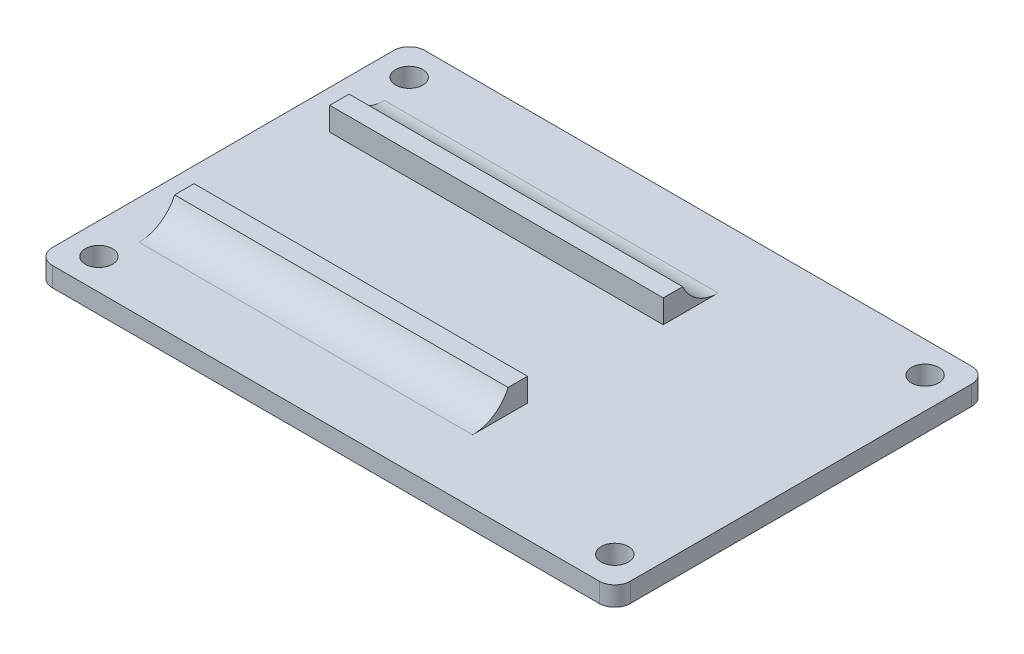
ISO-10303-21;
HEADER;
FILE_DESCRIPTION(('STEP AP214'),'2;1');
FILE_NAME('part.step','',(''),(''),'','','');
FILE_SCHEMA(('AUTOMOTIVE_DESIGN { 1 0 10303 214 1 1 1 1 }'));
ENDSEC;
DATA;
#1=APPLICATION_CONTEXT('core data for automotive mechanical design processes');
#2=APPLICATION_PROTOCOL_DEFINITION('international standard','automotive_design',2000,#1);
#3=PRODUCT_CONTEXT('',#1,'mechanical');
#4=PRODUCT('Part','Part','',(#3));
#5=PRODUCT_RELATED_PRODUCT_CATEGORY('part','',(#4));
#6=PRODUCT_DEFINITION_FORMATION('','',#4);
#7=PRODUCT_DEFINITION_CONTEXT('part definition',#1,'design');
#8=PRODUCT_DEFINITION('design','',#6,#7);
#9=PRODUCT_DEFINITION_SHAPE('','',#8);
#10=(LENGTH_UNIT() NAMED_UNIT(*) SI_UNIT(.MILLI.,.METRE.));
#11=(NAMED_UNIT(*) PLANE_ANGLE_UNIT() SI_UNIT($,.RADIAN.));
#12=(NAMED_UNIT(*) SI_UNIT($,.STERADIAN.) SOLID_ANGLE_UNIT());
#13=UNCERTAINTY_MEASURE_WITH_UNIT(LENGTH_MEASURE(1.E-05),#10,'distance_accuracy_value','');
#14=(GEOMETRIC_REPRESENTATION_CONTEXT(3) GLOBAL_UNCERTAINTY_ASSIGNED_CONTEXT((#13)) GLOBAL_UNIT_ASSIGNED_CONTEXT((#10,
#11,#12)) REPRESENTATION_CONTEXT('',''));
#15=CARTESIAN_POINT('',(0.,0.,0.));
#16=DIRECTION('',(0.,0.,1.));
#17=DIRECTION('',(1.,0.,0.));
#18=AXIS2_PLACEMENT_3D('',#15,#16,#17);
#19=CARTESIAN_POINT('',(-52.4762747985287,2.5,24.6659710997723));
#20=DIRECTION('',(0.,-1.,0.));
#21=DIRECTION('',(0.,0.,-1.));
#22=AXIS2_PLACEMENT_3D('',#19,#20,#21);
#23=PLANE('',#22);
#24=DIRECTION('',(0.,0.,1.));
#25=VECTOR('',#24,1.);
#26=CARTESIAN_POINT('',(-49.4762747985287,2.5,-8.58402890022771));
#27=LINE('',#26,#25);
#28=CARTESIAN_POINT('',(-49.4762747985287,2.5,-13.1666045951835));
#29=VERTEX_POINT('',#28);
#30=CARTESIAN_POINT('',(-49.4762747985287,2.5,-6.08402890022771));
#31=VERTEX_POINT('',#30);
#32=EDGE_CURVE('E48',#29,#31,#27,.T.);
#33=ORIENTED_EDGE('',*,*,#32,.F.);
#34=DIRECTION('',(-1.,0.,0.));
#35=VECTOR('',#34,1.);
#36=CARTESIAN_POINT('',(-52.4762747985287,2.5,-13.1666045951835));
#37=LINE('',#36,#35);
#38=CARTESIAN_POINT('',(-6.47627479852869,2.5,-13.1666045951835));
#39=VERTEX_POINT('',#38);
#40=EDGE_CURVE('E281',#29,#39,#37,.F.);
#41=ORIENTED_EDGE('',*,*,#40,.T.);
#42=DIRECTION('',(0.,0.,-1.));
#43=VECTOR('',#42,1.);
#44=CARTESIAN_POINT('',(-6.47627479852869,2.5,-6.08402890022771));
#45=LINE('',#44,#43);
#46=CARTESIAN_POINT('',(-6.47627479852869,2.5,-6.08402890022771));
#47=VERTEX_POINT('',#46);
#48=EDGE_CURVE('E56',#47,#39,#45,.T.);
#49=ORIENTED_EDGE('',*,*,#48,.F.);
#50=DIRECTION('',(1.,0.,0.));
#51=VECTOR('',#50,1.);
#52=CARTESIAN_POINT('',(-49.4762747985287,2.5,-6.08402890022771));
#53=LINE('',#52,#51);
#54=EDGE_CURVE('E172',#31,#47,#53,.T.);
#55=ORIENTED_EDGE('',*,*,#54,.F.);
#56=EDGE_LOOP('',(#33,#41,#49,#55));
#57=FACE_BOUND('',#56,.T.);
#58=CARTESIAN_POINT('',(-52.4762747985287,2.5,24.6659710997723));
#59=DIRECTION('',(0.,1.,0.));
#60=DIRECTION('',(0.,0.,-1.));
#61=AXIS2_PLACEMENT_3D('',#58,#59,#60);
#62=CIRCLE('',#61,2.);
#63=CARTESIAN_POINT('',(-54.4762747985287,2.5,24.6659710997723));
#64=VERTEX_POINT('',#63);
#65=CARTESIAN_POINT('',(-52.4762747985287,2.5,26.6659710997723));
#66=VERTEX_POINT('',#65);
#67=EDGE_CURVE('E221',#64,#66,#62,.T.);
#68=ORIENTED_EDGE('',*,*,#67,.T.);
#69=DIRECTION('',(1.,0.,0.));
#70=VECTOR('',#69,1.);
#71=CARTESIAN_POINT('',(18.0237252014713,2.5,26.6659710997723));
#72=LINE('',#71,#70);
#73=CARTESIAN_POINT('',(18.0237252014713,2.5,26.6659710997723));
#74=VERTEX_POINT('',#73);
#75=EDGE_CURVE('E224',#66,#74,#72,.T.);
#76=ORIENTED_EDGE('',*,*,#75,.T.);
#77=CARTESIAN_POINT('',(18.0237252014713,2.5,24.6659710997723));
#78=DIRECTION('',(0.,1.,0.));
#79=DIRECTION('',(0.,0.,-1.));
#80=AXIS2_PLACEMENT_3D('',#77,#78,#79);
#81=CIRCLE('',#80,2.);
#82=CARTESIAN_POINT('',(20.0237252014713,2.5,24.6659710997723));
#83=VERTEX_POINT('',#82);
#84=EDGE_CURVE('E227',#74,#83,#81,.T.);
#85=ORIENTED_EDGE('',*,*,#84,.T.);
#86=DIRECTION('',(0.,0.,-1.));
#87=VECTOR('',#86,1.);
#88=CARTESIAN_POINT('',(20.0237252014713,2.5,-19.3340289002277));
#89=LINE('',#88,#87);
#90=CARTESIAN_POINT('',(20.0237252014713,2.5,-19.3340289002277));
#91=VERTEX_POINT('',#90);
#92=EDGE_CURVE('E229',#83,#91,#89,.T.);
#93=ORIENTED_EDGE('',*,*,#92,.T.);
#94=CARTESIAN_POINT('',(18.0237252014713,2.5,-19.3340289002277));
#95=DIRECTION('',(0.,1.,0.));
#96=DIRECTION('',(0.,0.,-1.));
#97=AXIS2_PLACEMENT_3D('',#94,#95,#96);
#98=CIRCLE('',#97,2.);
#99=CARTESIAN_POINT('',(18.0237252014713,2.5,-21.3340289002277));
#100=VERTEX_POINT('',#99);
#101=EDGE_CURVE('E231',#91,#100,#98,.T.);
#102=ORIENTED_EDGE('',*,*,#101,.T.);
#103=DIRECTION('',(-1.,0.,0.));
#104=VECTOR('',#103,1.);
#105=CARTESIAN_POINT('',(-52.4762747985287,2.5,-21.3340289002277));
#106=LINE('',#105,#104);
#107=CARTESIAN_POINT('',(-52.4762747985287,2.5,-21.3340289002277));
#108=VERTEX_POINT('',#107);
#109=EDGE_CURVE('E233',#100,#108,#106,.T.);
#110=ORIENTED_EDGE('',*,*,#109,.T.);
#111=CARTESIAN_POINT('',(-52.4762747985287,2.5,-19.3340289002277));
#112=DIRECTION('',(0.,1.,0.));
#113=DIRECTION('',(0.,0.,-1.));
#114=AXIS2_PLACEMENT_3D('',#111,#112,#113);
#115=CIRCLE('',#114,2.);
#116=CARTESIAN_POINT('',(-54.4762747985287,2.5,-19.3340289002277));
#117=VERTEX_POINT('',#116);
#118=EDGE_CURVE('E235',#108,#117,#115,.T.);
#119=ORIENTED_EDGE('',*,*,#118,.T.);
#120=DIRECTION('',(0.,0.,1.));
#121=VECTOR('',#120,1.);
#122=CARTESIAN_POINT('',(-54.4762747985287,2.5,24.6659710997723));
#123=LINE('',#122,#121);
#124=EDGE_CURVE('E237',#117,#64,#123,.T.);
#125=ORIENTED_EDGE('',*,*,#124,.T.);
#126=EDGE_LOOP('',(#68,#76,#85,#93,#102,#110,#119,#125));
#127=FACE_BOUND('',#126,.T.);
#128=CARTESIAN_POINT('',(-50.4762747985287,2.5,-17.3340289002277));
#129=DIRECTION('',(0.,1.,0.));
#130=DIRECTION('',(0.,0.,1.));
#131=AXIS2_PLACEMENT_3D('',#128,#129,#130);
#132=CIRCLE('',#131,1.75);
#133=CARTESIAN_POINT('',(-50.4762747985287,2.5,-15.5840289002277));
#134=VERTEX_POINT('',#133);
#135=EDGE_CURVE('E215',#134,#134,#132,.T.);
#136=ORIENTED_EDGE('',*,*,#135,.F.);
#137=EDGE_LOOP('',(#136));
#138=FACE_BOUND('',#137,.T.);
#139=CARTESIAN_POINT('',(16.0237252014713,2.5,-17.3340289002277));
#140=DIRECTION('',(0.,1.,0.));
#141=DIRECTION('',(0.,0.,1.));
#142=AXIS2_PLACEMENT_3D('',#139,#140,#141);
#143=CIRCLE('',#142,1.75);
#144=CARTESIAN_POINT('',(16.0237252014713,2.5,-15.5840289002277));
#145=VERTEX_POINT('',#144);
#146=EDGE_CURVE('E209',#145,#145,#143,.T.);
#147=ORIENTED_EDGE('',*,*,#146,.F.);
#148=EDGE_LOOP('',(#147));
#149=FACE_BOUND('',#148,.T.);
#150=CARTESIAN_POINT('',(16.0237252014713,2.5,22.6659710997723));
#151=DIRECTION('',(0.,1.,0.));
#152=DIRECTION('',(0.,0.,1.));
#153=AXIS2_PLACEMENT_3D('',#150,#151,#152);
#154=CIRCLE('',#153,1.75);
#155=CARTESIAN_POINT('',(16.0237252014713,2.5,24.4159710997723));
#156=VERTEX_POINT('',#155);
#157=EDGE_CURVE('E203',#156,#156,#154,.T.);
#158=ORIENTED_EDGE('',*,*,#157,.F.);
#159=EDGE_LOOP('',(#158));
#160=FACE_BOUND('',#159,.T.);
#161=CARTESIAN_POINT('',(-50.4762747985287,2.5,22.6659710997723));
#162=DIRECTION('',(0.,1.,0.));
#163=DIRECTION('',(0.,0.,1.));
#164=AXIS2_PLACEMENT_3D('',#161,#162,#163);
#165=CIRCLE('',#164,1.75);
#166=CARTESIAN_POINT('',(-50.4762747985287,2.5,24.4159710997723));
#167=VERTEX_POINT('',#166);
#168=EDGE_CURVE('E197',#167,#167,#165,.T.);
#169=ORIENTED_EDGE('',*,*,#168,.F.);
#170=EDGE_LOOP('',(#169));
#171=FACE_BOUND('',#170,.T.);
#172=DIRECTION('',(0.,0.,-1.));
#173=VECTOR('',#172,1.);
#174=CARTESIAN_POINT('',(-6.47627479852869,2.5,13.9159710997723));
#175=LINE('',#174,#173);
#176=CARTESIAN_POINT('',(-6.47627479852869,2.5,18.4985467947281));
#177=VERTEX_POINT('',#176);
#178=CARTESIAN_POINT('',(-6.47627479852869,2.5,11.4159710997723));
#179=VERTEX_POINT('',#178);
#180=EDGE_CURVE('E170',#177,#179,#175,.T.);
#181=ORIENTED_EDGE('',*,*,#180,.F.);
#182=DIRECTION('',(1.,0.,0.));
#183=VECTOR('',#182,1.);
#184=CARTESIAN_POINT('',(-52.4762747985287,2.5,18.4985467947281));
#185=LINE('',#184,#183);
#186=CARTESIAN_POINT('',(-49.4762747985287,2.5,18.4985467947281));
#187=VERTEX_POINT('',#186);
#188=EDGE_CURVE('E278',#177,#187,#185,.F.);
#189=ORIENTED_EDGE('',*,*,#188,.T.);
#190=DIRECTION('',(0.,0.,1.));
#191=VECTOR('',#190,1.);
#192=CARTESIAN_POINT('',(-49.4762747985287,2.5,11.4159710997723));
#193=LINE('',#192,#191);
#194=CARTESIAN_POINT('',(-49.4762747985287,2.5,11.4159710997723));
#195=VERTEX_POINT('',#194);
#196=EDGE_CURVE('E167',#195,#187,#193,.T.);
#197=ORIENTED_EDGE('',*,*,#196,.F.);
#198=DIRECTION('',(-1.,0.,0.));
#199=VECTOR('',#198,1.);
#200=CARTESIAN_POINT('',(-6.47627479852869,2.5,11.4159710997723));
#201=LINE('',#200,#199);
#202=EDGE_CURVE('E290',#179,#195,#201,.T.);
#203=ORIENTED_EDGE('',*,*,#202,.F.);
#204=EDGE_LOOP('',(#181,#189,#197,#203));
#205=FACE_BOUND('',#204,.T.);
#206=ADVANCED_FACE('F33',(#57,#127,#138,#149,#160,#171,#205),#23,.F.);
#207=CARTESIAN_POINT('',(-52.4762747985287,0.,24.6659710997723));
#208=DIRECTION('',(0.,-1.,0.));
#209=DIRECTION('',(0.,0.,-1.));
#210=AXIS2_PLACEMENT_3D('',#207,#208,#209);
#211=PLANE('',#210);
#212=CARTESIAN_POINT('',(16.0237252014713,0.,22.6659710997723));
#213=DIRECTION('',(0.,1.,0.));
#214=DIRECTION('',(0.,0.,1.));
#215=AXIS2_PLACEMENT_3D('',#212,#213,#214);
#216=CIRCLE('',#215,1.75);
#217=CARTESIAN_POINT('',(16.0237252014713,0.,24.4159710997723));
#218=VERTEX_POINT('',#217);
#219=EDGE_CURVE('E200',#218,#218,#216,.T.);
#220=ORIENTED_EDGE('',*,*,#219,.T.);
#221=EDGE_LOOP('',(#220));
#222=FACE_BOUND('',#221,.T.);
#223=CARTESIAN_POINT('',(-50.4762747985287,0.,-17.3340289002277));
#224=DIRECTION('',(0.,1.,0.));
#225=DIRECTION('',(0.,0.,1.));
#226=AXIS2_PLACEMENT_3D('',#223,#224,#225);
#227=CIRCLE('',#226,1.75);
#228=CARTESIAN_POINT('',(-50.4762747985287,0.,-15.5840289002277));
#229=VERTEX_POINT('',#228);
#230=EDGE_CURVE('E212',#229,#229,#227,.T.);
#231=ORIENTED_EDGE('',*,*,#230,.T.);
#232=EDGE_LOOP('',(#231));
#233=FACE_BOUND('',#232,.T.);
#234=CARTESIAN_POINT('',(-52.4762747985287,0.,24.6659710997723));
#235=DIRECTION('',(0.,1.,0.));
#236=DIRECTION('',(0.,0.,-1.));
#237=AXIS2_PLACEMENT_3D('',#234,#235,#236);
#238=CIRCLE('',#237,2.);
#239=CARTESIAN_POINT('',(-54.4762747985287,0.,24.6659710997723));
#240=VERTEX_POINT('',#239);
#241=CARTESIAN_POINT('',(-52.4762747985287,0.,26.6659710997723));
#242=VERTEX_POINT('',#241);
#243=EDGE_CURVE('E218',#240,#242,#238,.T.);
#244=ORIENTED_EDGE('',*,*,#243,.F.);
#245=DIRECTION('',(0.,0.,1.));
#246=VECTOR('',#245,1.);
#247=CARTESIAN_POINT('',(-54.4762747985287,0.,24.6659710997723));
#248=LINE('',#247,#246);
#249=CARTESIAN_POINT('',(-54.4762747985287,0.,-19.3340289002277));
#250=VERTEX_POINT('',#249);
#251=EDGE_CURVE('E225',#250,#240,#248,.T.);
#252=ORIENTED_EDGE('',*,*,#251,.F.);
#253=CARTESIAN_POINT('',(-52.4762747985287,0.,-19.3340289002277));
#254=DIRECTION('',(0.,1.,0.));
#255=DIRECTION('',(0.,0.,-1.));
#256=AXIS2_PLACEMENT_3D('',#253,#254,#255);
#257=CIRCLE('',#256,2.);
#258=CARTESIAN_POINT('',(-52.4762747985287,0.,-21.3340289002277));
#259=VERTEX_POINT('',#258);
#260=EDGE_CURVE('E252',#259,#250,#257,.T.);
#261=ORIENTED_EDGE('',*,*,#260,.F.);
#262=DIRECTION('',(-1.,0.,0.));
#263=VECTOR('',#262,1.);
#264=CARTESIAN_POINT('',(-52.4762747985287,0.,-21.3340289002277));
#265=LINE('',#264,#263);
#266=CARTESIAN_POINT('',(18.0237252014713,0.,-21.3340289002277));
#267=VERTEX_POINT('',#266);
#268=EDGE_CURVE('E250',#267,#259,#265,.T.);
#269=ORIENTED_EDGE('',*,*,#268,.F.);
#270=CARTESIAN_POINT('',(18.0237252014713,0.,-19.3340289002277));
#271=DIRECTION('',(0.,1.,0.));
#272=DIRECTION('',(0.,0.,-1.));
#273=AXIS2_PLACEMENT_3D('',#270,#271,#272);
#274=CIRCLE('',#273,2.);
#275=CARTESIAN_POINT('',(20.0237252014713,0.,-19.3340289002277));
#276=VERTEX_POINT('',#275);
#277=EDGE_CURVE('E248',#276,#267,#274,.T.);
#278=ORIENTED_EDGE('',*,*,#277,.F.);
#279=DIRECTION('',(0.,0.,-1.));
#280=VECTOR('',#279,1.);
#281=CARTESIAN_POINT('',(20.0237252014713,0.,-19.3340289002277));
#282=LINE('',#281,#280);
#283=CARTESIAN_POINT('',(20.0237252014713,0.,24.6659710997723));
#284=VERTEX_POINT('',#283);
#285=EDGE_CURVE('E246',#284,#276,#282,.T.);
#286=ORIENTED_EDGE('',*,*,#285,.F.);
#287=CARTESIAN_POINT('',(18.0237252014713,0.,24.6659710997723));
#288=DIRECTION('',(0.,1.,0.));
#289=DIRECTION('',(0.,0.,-1.));
#290=AXIS2_PLACEMENT_3D('',#287,#288,#289);
#291=CIRCLE('',#290,2.);
#292=CARTESIAN_POINT('',(18.0237252014713,0.,26.6659710997723));
#293=VERTEX_POINT('',#292);
#294=EDGE_CURVE('E244',#293,#284,#291,.T.);
#295=ORIENTED_EDGE('',*,*,#294,.F.);
#296=DIRECTION('',(1.,0.,0.));
#297=VECTOR('',#296,1.);
#298=CARTESIAN_POINT('',(18.0237252014713,0.,26.6659710997723));
#299=LINE('',#298,#297);
#300=EDGE_CURVE('E242',#242,#293,#299,.T.);
#301=ORIENTED_EDGE('',*,*,#300,.F.);
#302=EDGE_LOOP('',(#244,#252,#261,#269,#278,#286,#295,#301));
#303=FACE_BOUND('',#302,.T.);
#304=CARTESIAN_POINT('',(16.0237252014713,0.,-17.3340289002277));
#305=DIRECTION('',(0.,1.,0.));
#306=DIRECTION('',(0.,0.,1.));
#307=AXIS2_PLACEMENT_3D('',#304,#305,#306);
#308=CIRCLE('',#307,1.75);
#309=CARTESIAN_POINT('',(16.0237252014713,0.,-15.5840289002277));
#310=VERTEX_POINT('',#309);
#311=EDGE_CURVE('E206',#310,#310,#308,.T.);
#312=ORIENTED_EDGE('',*,*,#311,.T.);
#313=EDGE_LOOP('',(#312));
#314=FACE_BOUND('',#313,.T.);
#315=CARTESIAN_POINT('',(-50.4762747985287,0.,22.6659710997723));
#316=DIRECTION('',(0.,1.,0.));
#317=DIRECTION('',(0.,0.,1.));
#318=AXIS2_PLACEMENT_3D('',#315,#316,#317);
#319=CIRCLE('',#318,1.75);
#320=CARTESIAN_POINT('',(-50.4762747985287,0.,24.4159710997723));
#321=VERTEX_POINT('',#320);
#322=EDGE_CURVE('E196',#321,#321,#319,.T.);
#323=ORIENTED_EDGE('',*,*,#322,.T.);
#324=EDGE_LOOP('',(#323));
#325=FACE_BOUND('',#324,.T.);
#326=ADVANCED_FACE('F307',(#222,#233,#303,#314,#325),#211,.T.);
#327=CARTESIAN_POINT('',(-52.4762747985287,2.5,24.6659710997723));
#328=DIRECTION('',(0.,-1.,0.));
#329=DIRECTION('',(0.,0.,-1.));
#330=AXIS2_PLACEMENT_3D('',#327,#328,#329);
#331=CYLINDRICAL_SURFACE('',#330,2.);
#332=ORIENTED_EDGE('',*,*,#243,.T.);
#333=DIRECTION('',(0.,-1.,0.));
#334=VECTOR('',#333,1.);
#335=CARTESIAN_POINT('',(-52.4762747985287,2.5,26.6659710997723));
#336=LINE('',#335,#334);
#337=EDGE_CURVE('E275',#66,#242,#336,.T.);
#338=ORIENTED_EDGE('',*,*,#337,.F.);
#339=ORIENTED_EDGE('',*,*,#67,.F.);
#340=DIRECTION('',(0.,-1.,0.));
#341=VECTOR('',#340,1.);
#342=CARTESIAN_POINT('',(-54.4762747985287,2.5,24.6659710997723));
#343=LINE('',#342,#341);
#344=EDGE_CURVE('E239',#64,#240,#343,.T.);
#345=ORIENTED_EDGE('',*,*,#344,.T.);
#346=EDGE_LOOP('',(#332,#338,#339,#345));
#347=FACE_BOUND('',#346,.T.);
#348=ADVANCED_FACE('F312',(#347),#331,.T.);
#349=CARTESIAN_POINT('',(18.0237252014713,2.5,26.6659710997723));
#350=DIRECTION('',(0.,0.,-1.));
#351=DIRECTION('',(-1.,0.,0.));
#352=AXIS2_PLACEMENT_3D('',#349,#350,#351);
#353=PLANE('',#352);
#354=ORIENTED_EDGE('',*,*,#300,.T.);
#355=DIRECTION('',(0.,-1.,0.));
#356=VECTOR('',#355,1.);
#357=CARTESIAN_POINT('',(18.0237252014713,2.5,26.6659710997723));
#358=LINE('',#357,#356);
#359=EDGE_CURVE('E272',#74,#293,#358,.T.);
#360=ORIENTED_EDGE('',*,*,#359,.F.);
#361=ORIENTED_EDGE('',*,*,#75,.F.);
#362=ORIENTED_EDGE('',*,*,#337,.T.);
#363=EDGE_LOOP('',(#354,#360,#361,#362));
#364=FACE_BOUND('',#363,.T.);
#365=ADVANCED_FACE('F343',(#364),#353,.F.);
#366=CARTESIAN_POINT('',(18.0237252014713,2.5,24.6659710997723));
#367=DIRECTION('',(0.,-1.,0.));
#368=DIRECTION('',(0.,0.,-1.));
#369=AXIS2_PLACEMENT_3D('',#366,#367,#368);
#370=CYLINDRICAL_SURFACE('',#369,2.);
#371=ORIENTED_EDGE('',*,*,#294,.T.);
#372=DIRECTION('',(0.,-1.,0.));
#373=VECTOR('',#372,1.);
#374=CARTESIAN_POINT('',(20.0237252014713,2.5,24.6659710997723));
#375=LINE('',#374,#373);
#376=EDGE_CURVE('E269',#83,#284,#375,.T.);
#377=ORIENTED_EDGE('',*,*,#376,.F.);
#378=ORIENTED_EDGE('',*,*,#84,.F.);
#379=ORIENTED_EDGE('',*,*,#359,.T.);
#380=EDGE_LOOP('',(#371,#377,#378,#379));
#381=FACE_BOUND('',#380,.T.);
#382=ADVANCED_FACE('F339',(#381),#370,.T.);
#383=CARTESIAN_POINT('',(20.0237252014713,2.5,-19.3340289002277));
#384=DIRECTION('',(-1.,0.,0.));
#385=DIRECTION('',(0.,0.,1.));
#386=AXIS2_PLACEMENT_3D('',#383,#384,#385);
#387=PLANE('',#386);
#388=ORIENTED_EDGE('',*,*,#285,.T.);
#389=DIRECTION('',(0.,-1.,0.));
#390=VECTOR('',#389,1.);
#391=CARTESIAN_POINT('',(20.0237252014713,2.5,-19.3340289002277));
#392=LINE('',#391,#390);
#393=EDGE_CURVE('E266',#91,#276,#392,.T.);
#394=ORIENTED_EDGE('',*,*,#393,.F.);
#395=ORIENTED_EDGE('',*,*,#92,.F.);
#396=ORIENTED_EDGE('',*,*,#376,.T.);
#397=EDGE_LOOP('',(#388,#394,#395,#396));
#398=FACE_BOUND('',#397,.T.);
#399=ADVANCED_FACE('F335',(#398),#387,.F.);
#400=CARTESIAN_POINT('',(18.0237252014713,2.5,-19.3340289002277));
#401=DIRECTION('',(0.,-1.,0.));
#402=DIRECTION('',(0.,0.,-1.));
#403=AXIS2_PLACEMENT_3D('',#400,#401,#402);
#404=CYLINDRICAL_SURFACE('',#403,2.);
#405=ORIENTED_EDGE('',*,*,#277,.T.);
#406=DIRECTION('',(0.,-1.,0.));
#407=VECTOR('',#406,1.);
#408=CARTESIAN_POINT('',(18.0237252014713,2.5,-21.3340289002277));
#409=LINE('',#408,#407);
#410=EDGE_CURVE('E263',#100,#267,#409,.T.);
#411=ORIENTED_EDGE('',*,*,#410,.F.);
#412=ORIENTED_EDGE('',*,*,#101,.F.);
#413=ORIENTED_EDGE('',*,*,#393,.T.);
#414=EDGE_LOOP('',(#405,#411,#412,#413));
#415=FACE_BOUND('',#414,.T.);
#416=ADVANCED_FACE('F331',(#415),#404,.T.);
#417=CARTESIAN_POINT('',(-52.4762747985287,2.5,-21.3340289002277));
#418=DIRECTION('',(0.,0.,1.));
#419=DIRECTION('',(1.,0.,0.));
#420=AXIS2_PLACEMENT_3D('',#417,#418,#419);
#421=PLANE('',#420);
#422=ORIENTED_EDGE('',*,*,#268,.T.);
#423=DIRECTION('',(0.,-1.,0.));
#424=VECTOR('',#423,1.);
#425=CARTESIAN_POINT('',(-52.4762747985287,2.5,-21.3340289002277));
#426=LINE('',#425,#424);
#427=EDGE_CURVE('E260',#108,#259,#426,.T.);
#428=ORIENTED_EDGE('',*,*,#427,.F.);
#429=ORIENTED_EDGE('',*,*,#109,.F.);
#430=ORIENTED_EDGE('',*,*,#410,.T.);
#431=EDGE_LOOP('',(#422,#428,#429,#430));
#432=FACE_BOUND('',#431,.T.);
#433=ADVANCED_FACE('F327',(#432),#421,.F.);
#434=CARTESIAN_POINT('',(-52.4762747985287,2.5,-19.3340289002277));
#435=DIRECTION('',(0.,-1.,0.));
#436=DIRECTION('',(0.,0.,-1.));
#437=AXIS2_PLACEMENT_3D('',#434,#435,#436);
#438=CYLINDRICAL_SURFACE('',#437,2.);
#439=ORIENTED_EDGE('',*,*,#260,.T.);
#440=DIRECTION('',(0.,-1.,0.));
#441=VECTOR('',#440,1.);
#442=CARTESIAN_POINT('',(-54.4762747985287,2.5,-19.3340289002277));
#443=LINE('',#442,#441);
#444=EDGE_CURVE('E257',#117,#250,#443,.T.);
#445=ORIENTED_EDGE('',*,*,#444,.F.);
#446=ORIENTED_EDGE('',*,*,#118,.F.);
#447=ORIENTED_EDGE('',*,*,#427,.T.);
#448=EDGE_LOOP('',(#439,#445,#446,#447));
#449=FACE_BOUND('',#448,.T.);
#450=ADVANCED_FACE('F323',(#449),#438,.T.);
#451=CARTESIAN_POINT('',(-54.4762747985287,2.5,24.6659710997723));
#452=DIRECTION('',(1.,0.,0.));
#453=DIRECTION('',(0.,0.,-1.));
#454=AXIS2_PLACEMENT_3D('',#451,#452,#453);
#455=PLANE('',#454);
#456=ORIENTED_EDGE('',*,*,#251,.T.);
#457=ORIENTED_EDGE('',*,*,#344,.F.);
#458=ORIENTED_EDGE('',*,*,#124,.F.);
#459=ORIENTED_EDGE('',*,*,#444,.T.);
#460=EDGE_LOOP('',(#456,#457,#458,#459));
#461=FACE_BOUND('',#460,.T.);
#462=ADVANCED_FACE('F320',(#461),#455,.F.);
#463=CARTESIAN_POINT('',(-50.4762747985287,2.5,-17.3340289002277));
#464=DIRECTION('',(0.,-1.,0.));
#465=DIRECTION('',(0.,0.,-1.));
#466=AXIS2_PLACEMENT_3D('',#463,#464,#465);
#467=CYLINDRICAL_SURFACE('',#466,1.75);
#468=ORIENTED_EDGE('',*,*,#135,.T.);
#469=EDGE_LOOP('',(#468));
#470=FACE_BOUND('',#469,.T.);
#471=ORIENTED_EDGE('',*,*,#230,.F.);
#472=EDGE_LOOP('',(#471));
#473=FACE_BOUND('',#472,.T.);
#474=ADVANCED_FACE('F317',(#470,#473),#467,.F.);
#475=CARTESIAN_POINT('',(16.0237252014713,2.5,-17.3340289002277));
#476=DIRECTION('',(0.,-1.,0.));
#477=DIRECTION('',(0.,0.,-1.));
#478=AXIS2_PLACEMENT_3D('',#475,#476,#477);
#479=CYLINDRICAL_SURFACE('',#478,1.75);
#480=ORIENTED_EDGE('',*,*,#146,.T.);
#481=EDGE_LOOP('',(#480));
#482=FACE_BOUND('',#481,.T.);
#483=ORIENTED_EDGE('',*,*,#311,.F.);
#484=EDGE_LOOP('',(#483));
#485=FACE_BOUND('',#484,.T.);
#486=ADVANCED_FACE('F383',(#482,#485),#479,.F.);
#487=CARTESIAN_POINT('',(16.0237252014713,2.5,22.6659710997723));
#488=DIRECTION('',(0.,-1.,0.));
#489=DIRECTION('',(0.,0.,-1.));
#490=AXIS2_PLACEMENT_3D('',#487,#488,#489);
#491=CYLINDRICAL_SURFACE('',#490,1.75);
#492=ORIENTED_EDGE('',*,*,#157,.T.);
#493=EDGE_LOOP('',(#492));
#494=FACE_BOUND('',#493,.T.);
#495=ORIENTED_EDGE('',*,*,#219,.F.);
#496=EDGE_LOOP('',(#495));
#497=FACE_BOUND('',#496,.T.);
#498=ADVANCED_FACE('F377',(#494,#497),#491,.F.);
#499=CARTESIAN_POINT('',(-50.4762747985287,2.5,22.6659710997723));
#500=DIRECTION('',(0.,-1.,0.));
#501=DIRECTION('',(0.,0.,-1.));
#502=AXIS2_PLACEMENT_3D('',#499,#500,#501);
#503=CYLINDRICAL_SURFACE('',#502,1.75);
#504=ORIENTED_EDGE('',*,*,#168,.T.);
#505=EDGE_LOOP('',(#504));
#506=FACE_BOUND('',#505,.T.);
#507=ORIENTED_EDGE('',*,*,#322,.F.);
#508=EDGE_LOOP('',(#507));
#509=FACE_BOUND('',#508,.T.);
#510=ADVANCED_FACE('F370',(#506,#509),#503,.F.);
#511=CARTESIAN_POINT('',(-49.4762747985287,5.5,-8.58402890022771));
#512=DIRECTION('',(1.,0.,0.));
#513=DIRECTION('',(0.,0.,-1.));
#514=AXIS2_PLACEMENT_3D('',#511,#512,#513);
#515=PLANE('',#514);
#516=ORIENTED_EDGE('',*,*,#32,.T.);
#517=DIRECTION('',(0.,-1.,0.));
#518=VECTOR('',#517,1.);
#519=CARTESIAN_POINT('',(-49.4762747985287,5.5,-6.08402890022771));
#520=LINE('',#519,#518);
#521=CARTESIAN_POINT('',(-49.4762747985287,5.5,-6.08402890022771));
#522=VERTEX_POINT('',#521);
#523=EDGE_CURVE('E193',#522,#31,#520,.T.);
#524=ORIENTED_EDGE('',*,*,#523,.F.);
#525=DIRECTION('',(0.,0.,1.));
#526=VECTOR('',#525,1.);
#527=CARTESIAN_POINT('',(-49.4762747985287,5.5,-8.58402890022771));
#528=LINE('',#527,#526);
#529=CARTESIAN_POINT('',(-49.4762747985287,5.5,-8.58402890022771));
#530=VERTEX_POINT('',#529);
#531=EDGE_CURVE('E177',#530,#522,#528,.T.);
#532=ORIENTED_EDGE('',*,*,#531,.F.);
#533=CARTESIAN_POINT('',(-49.4762747985287,7.5,-13.1666045951835));
#534=DIRECTION('',(1.,0.,0.));
#535=DIRECTION('',(0.,0.,-1.));
#536=AXIS2_PLACEMENT_3D('',#533,#534,#535);
#537=CIRCLE('',#536,5.);
#538=EDGE_CURVE('E283',#530,#29,#537,.T.);
#539=ORIENTED_EDGE('',*,*,#538,.T.);
#540=EDGE_LOOP('',(#516,#524,#532,#539));
#541=FACE_BOUND('',#540,.T.);
#542=ADVANCED_FACE('F368',(#541),#515,.F.);
#543=CARTESIAN_POINT('',(-49.4762747985287,5.5,-6.08402890022771));
#544=DIRECTION('',(0.,0.,-1.));
#545=DIRECTION('',(-1.,0.,0.));
#546=AXIS2_PLACEMENT_3D('',#543,#544,#545);
#547=PLANE('',#546);
#548=ORIENTED_EDGE('',*,*,#54,.T.);
#549=DIRECTION('',(0.,-1.,0.));
#550=VECTOR('',#549,1.);
#551=CARTESIAN_POINT('',(-6.47627479852869,5.5,-6.08402890022771));
#552=LINE('',#551,#550);
#553=CARTESIAN_POINT('',(-6.47627479852869,5.5,-6.08402890022771));
#554=VERTEX_POINT('',#553);
#555=EDGE_CURVE('E187',#554,#47,#552,.T.);
#556=ORIENTED_EDGE('',*,*,#555,.F.);
#557=DIRECTION('',(1.,0.,0.));
#558=VECTOR('',#557,1.);
#559=CARTESIAN_POINT('',(-49.4762747985287,5.5,-6.08402890022771));
#560=LINE('',#559,#558);
#561=EDGE_CURVE('E180',#522,#554,#560,.T.);
#562=ORIENTED_EDGE('',*,*,#561,.F.);
#563=ORIENTED_EDGE('',*,*,#523,.T.);
#564=EDGE_LOOP('',(#548,#556,#562,#563));
#565=FACE_BOUND('',#564,.T.);
#566=ADVANCED_FACE('F366',(#565),#547,.F.);
#567=CARTESIAN_POINT('',(-6.47627479852869,5.5,-6.08402890022771));
#568=DIRECTION('',(-1.,0.,0.));
#569=DIRECTION('',(0.,0.,1.));
#570=AXIS2_PLACEMENT_3D('',#567,#568,#569);
#571=PLANE('',#570);
#572=ORIENTED_EDGE('',*,*,#48,.T.);
#573=CARTESIAN_POINT('',(-6.47627479852869,7.5,-13.1666045951835));
#574=DIRECTION('',(-1.,0.,0.));
#575=DIRECTION('',(0.,0.,1.));
#576=AXIS2_PLACEMENT_3D('',#573,#574,#575);
#577=CIRCLE('',#576,5.);
#578=CARTESIAN_POINT('',(-6.47627479852869,5.5,-8.58402890022771));
#579=VERTEX_POINT('',#578);
#580=EDGE_CURVE('E285',#39,#579,#577,.T.);
#581=ORIENTED_EDGE('',*,*,#580,.T.);
#582=DIRECTION('',(0.,0.,-1.));
#583=VECTOR('',#582,1.);
#584=CARTESIAN_POINT('',(-6.47627479852869,5.5,-6.08402890022771));
#585=LINE('',#584,#583);
#586=EDGE_CURVE('E182',#554,#579,#585,.T.);
#587=ORIENTED_EDGE('',*,*,#586,.F.);
#588=ORIENTED_EDGE('',*,*,#555,.T.);
#589=EDGE_LOOP('',(#572,#581,#587,#588));
#590=FACE_BOUND('',#589,.T.);
#591=ADVANCED_FACE('F359',(#590),#571,.F.);
#592=CARTESIAN_POINT('',(0.,5.5,0.));
#593=DIRECTION('',(0.,1.,0.));
#594=DIRECTION('',(0.,0.,1.));
#595=AXIS2_PLACEMENT_3D('',#592,#593,#594);
#596=PLANE('',#595);
#597=ORIENTED_EDGE('',*,*,#531,.T.);
#598=ORIENTED_EDGE('',*,*,#561,.T.);
#599=ORIENTED_EDGE('',*,*,#586,.T.);
#600=DIRECTION('',(-1.,0.,0.));
#601=VECTOR('',#600,1.);
#602=CARTESIAN_POINT('',(-49.4762747985287,5.5,-8.58402890022771));
#603=LINE('',#602,#601);
#604=EDGE_CURVE('E185',#579,#530,#603,.T.);
#605=ORIENTED_EDGE('',*,*,#604,.T.);
#606=EDGE_LOOP('',(#597,#598,#599,#605));
#607=FACE_BOUND('',#606,.T.);
#608=ADVANCED_FACE('F361',(#607),#596,.T.);
#609=CARTESIAN_POINT('',(-6.47627479852869,5.5,13.9159710997723));
#610=DIRECTION('',(-1.,0.,0.));
#611=DIRECTION('',(0.,0.,1.));
#612=AXIS2_PLACEMENT_3D('',#609,#610,#611);
#613=PLANE('',#612);
#614=ORIENTED_EDGE('',*,*,#180,.T.);
#615=DIRECTION('',(0.,-1.,0.));
#616=VECTOR('',#615,1.);
#617=CARTESIAN_POINT('',(-6.47627479852869,5.5,11.4159710997723));
#618=LINE('',#617,#616);
#619=CARTESIAN_POINT('',(-6.47627479852869,5.5,11.4159710997723));
#620=VERTEX_POINT('',#619);
#621=EDGE_CURVE('E150',#620,#179,#618,.T.);
#622=ORIENTED_EDGE('',*,*,#621,.F.);
#623=DIRECTION('',(0.,0.,-1.));
#624=VECTOR('',#623,1.);
#625=CARTESIAN_POINT('',(-6.47627479852869,5.5,13.9159710997723));
#626=LINE('',#625,#624);
#627=CARTESIAN_POINT('',(-6.47627479852869,5.5,13.9159710997723));
#628=VERTEX_POINT('',#627);
#629=EDGE_CURVE('E158',#628,#620,#626,.T.);
#630=ORIENTED_EDGE('',*,*,#629,.F.);
#631=CARTESIAN_POINT('',(-6.47627479852869,7.5,18.4985467947281));
#632=DIRECTION('',(-1.,0.,0.));
#633=DIRECTION('',(0.,0.,1.));
#634=AXIS2_PLACEMENT_3D('',#631,#632,#633);
#635=CIRCLE('',#634,5.);
#636=EDGE_CURVE('E41',#628,#177,#635,.T.);
#637=ORIENTED_EDGE('',*,*,#636,.T.);
#638=EDGE_LOOP('',(#614,#622,#630,#637));
#639=FACE_BOUND('',#638,.T.);
#640=ADVANCED_FACE('F169',(#639),#613,.F.);
#641=CARTESIAN_POINT('',(-6.47627479852869,5.5,11.4159710997723));
#642=DIRECTION('',(0.,0.,1.));
#643=DIRECTION('',(1.,0.,0.));
#644=AXIS2_PLACEMENT_3D('',#641,#642,#643);
#645=PLANE('',#644);
#646=ORIENTED_EDGE('',*,*,#202,.T.);
#647=DIRECTION('',(0.,-1.,0.));
#648=VECTOR('',#647,1.);
#649=CARTESIAN_POINT('',(-49.4762747985287,5.5,11.4159710997723));
#650=LINE('',#649,#648);
#651=CARTESIAN_POINT('',(-49.4762747985287,5.5,11.4159710997723));
#652=VERTEX_POINT('',#651);
#653=EDGE_CURVE('E153',#652,#195,#650,.T.);
#654=ORIENTED_EDGE('',*,*,#653,.F.);
#655=DIRECTION('',(-1.,0.,0.));
#656=VECTOR('',#655,1.);
#657=CARTESIAN_POINT('',(-6.47627479852869,5.5,11.4159710997723));
#658=LINE('',#657,#656);
#659=EDGE_CURVE('E145',#620,#652,#658,.T.);
#660=ORIENTED_EDGE('',*,*,#659,.F.);
#661=ORIENTED_EDGE('',*,*,#621,.T.);
#662=EDGE_LOOP('',(#646,#654,#660,#661));
#663=FACE_BOUND('',#662,.T.);
#664=ADVANCED_FACE('F148',(#663),#645,.F.);
#665=CARTESIAN_POINT('',(-49.4762747985287,5.5,11.4159710997723));
#666=DIRECTION('',(1.,0.,0.));
#667=DIRECTION('',(0.,0.,-1.));
#668=AXIS2_PLACEMENT_3D('',#665,#666,#667);
#669=PLANE('',#668);
#670=ORIENTED_EDGE('',*,*,#196,.T.);
#671=CARTESIAN_POINT('',(-49.4762747985287,7.5,18.4985467947281));
#672=DIRECTION('',(1.,0.,0.));
#673=DIRECTION('',(0.,0.,-1.));
#674=AXIS2_PLACEMENT_3D('',#671,#672,#673);
#675=CIRCLE('',#674,5.);
#676=CARTESIAN_POINT('',(-49.4762747985287,5.5,13.9159710997723));
#677=VERTEX_POINT('',#676);
#678=EDGE_CURVE('E11',#187,#677,#675,.T.);
#679=ORIENTED_EDGE('',*,*,#678,.T.);
#680=DIRECTION('',(0.,0.,1.));
#681=VECTOR('',#680,1.);
#682=CARTESIAN_POINT('',(-49.4762747985287,5.5,11.4159710997723));
#683=LINE('',#682,#681);
#684=EDGE_CURVE('E157',#652,#677,#683,.T.);
#685=ORIENTED_EDGE('',*,*,#684,.F.);
#686=ORIENTED_EDGE('',*,*,#653,.T.);
#687=EDGE_LOOP('',(#670,#679,#685,#686));
#688=FACE_BOUND('',#687,.T.);
#689=ADVANCED_FACE('F296',(#688),#669,.F.);
#690=CARTESIAN_POINT('',(0.,5.5,0.));
#691=DIRECTION('',(0.,1.,0.));
#692=DIRECTION('',(0.,0.,1.));
#693=AXIS2_PLACEMENT_3D('',#690,#691,#692);
#694=PLANE('',#693);
#695=ORIENTED_EDGE('',*,*,#629,.T.);
#696=ORIENTED_EDGE('',*,*,#659,.T.);
#697=ORIENTED_EDGE('',*,*,#684,.T.);
#698=DIRECTION('',(1.,0.,0.));
#699=VECTOR('',#698,1.);
#700=CARTESIAN_POINT('',(-6.47627479852869,5.5,13.9159710997723));
#701=LINE('',#700,#699);
#702=EDGE_CURVE('E164',#677,#628,#701,.T.);
#703=ORIENTED_EDGE('',*,*,#702,.T.);
#704=EDGE_LOOP('',(#695,#696,#697,#703));
#705=FACE_BOUND('',#704,.T.);
#706=ADVANCED_FACE('F162',(#705),#694,.T.);
#707=CARTESIAN_POINT('',(-49.4762747985287,7.5,-13.1666045951835));
#708=DIRECTION('',(-1.,0.,0.));
#709=DIRECTION('',(0.,0.,1.));
#710=AXIS2_PLACEMENT_3D('',#707,#708,#709);
#711=CYLINDRICAL_SURFACE('',#710,5.);
#712=ORIENTED_EDGE('',*,*,#580,.F.);
#713=ORIENTED_EDGE('',*,*,#40,.F.);
#714=ORIENTED_EDGE('',*,*,#538,.F.);
#715=ORIENTED_EDGE('',*,*,#604,.F.);
#716=EDGE_LOOP('',(#712,#713,#714,#715));
#717=FACE_BOUND('',#716,.T.);
#718=ADVANCED_FACE('F303',(#717),#711,.F.);
#719=CARTESIAN_POINT('',(-6.47627479852869,7.5,18.4985467947281));
#720=DIRECTION('',(1.,0.,0.));
#721=DIRECTION('',(0.,0.,-1.));
#722=AXIS2_PLACEMENT_3D('',#719,#720,#721);
#723=CYLINDRICAL_SURFACE('',#722,5.);
#724=ORIENTED_EDGE('',*,*,#678,.F.);
#725=ORIENTED_EDGE('',*,*,#188,.F.);
#726=ORIENTED_EDGE('',*,*,#636,.F.);
#727=ORIENTED_EDGE('',*,*,#702,.F.);
#728=EDGE_LOOP('',(#724,#725,#726,#727));
#729=FACE_BOUND('',#728,.T.);
#730=ADVANCED_FACE('F35',(#729),#723,.F.);
#731=CLOSED_SHELL('',(#206,#326,#348,#365,#382,#399,#416,#433,#450,#462,#474,#486,#498,#510,
#542,#566,#591,#608,#640,#664,#689,#706,#718,#730));
#732=MANIFOLD_SOLID_BREP('B2',#731);
#733=ADVANCED_BREP_SHAPE_REPRESENTATION('',(#18,#732),#14);
#734=SHAPE_DEFINITION_REPRESENTATION(#9,#733);
ENDSEC;
END-ISO-10303-21;
